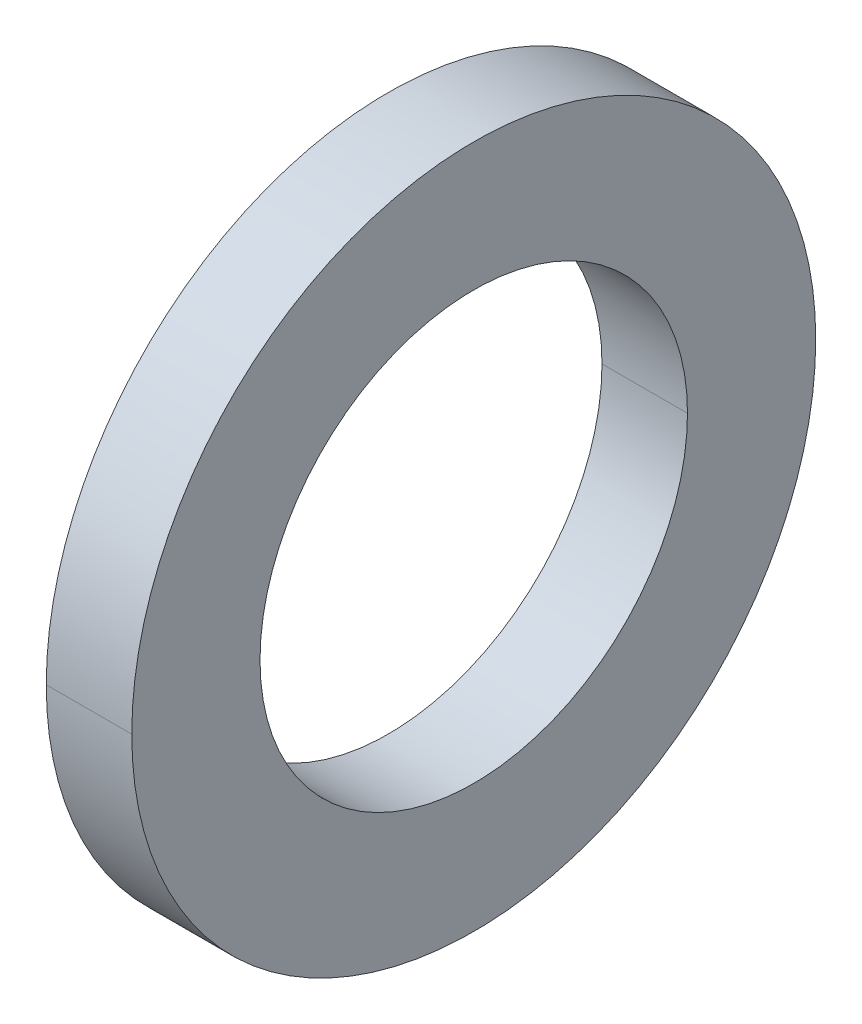
ISO-10303-21;
HEADER;
FILE_DESCRIPTION(('STEP AP214'),'2;1');
FILE_NAME('part.step','',(''),(''),'','','');
FILE_SCHEMA(('AUTOMOTIVE_DESIGN { 1 0 10303 214 1 1 1 1 }'));
ENDSEC;
DATA;
#1=APPLICATION_CONTEXT('core data for automotive mechanical design processes');
#2=APPLICATION_PROTOCOL_DEFINITION('international standard','automotive_design',2000,#1);
#3=PRODUCT_CONTEXT('',#1,'mechanical');
#4=PRODUCT('Part','Part','',(#3));
#5=PRODUCT_RELATED_PRODUCT_CATEGORY('part','',(#4));
#6=PRODUCT_DEFINITION_FORMATION('','',#4);
#7=PRODUCT_DEFINITION_CONTEXT('part definition',#1,'design');
#8=PRODUCT_DEFINITION('design','',#6,#7);
#9=PRODUCT_DEFINITION_SHAPE('','',#8);
#10=(LENGTH_UNIT() NAMED_UNIT(*) SI_UNIT(.MILLI.,.METRE.));
#11=(NAMED_UNIT(*) PLANE_ANGLE_UNIT() SI_UNIT($,.RADIAN.));
#12=(NAMED_UNIT(*) SI_UNIT($,.STERADIAN.) SOLID_ANGLE_UNIT());
#13=UNCERTAINTY_MEASURE_WITH_UNIT(LENGTH_MEASURE(1.E-05),#10,'distance_accuracy_value','');
#14=(GEOMETRIC_REPRESENTATION_CONTEXT(3) GLOBAL_UNCERTAINTY_ASSIGNED_CONTEXT((#13)) GLOBAL_UNIT_ASSIGNED_CONTEXT((#10,
#11,#12)) REPRESENTATION_CONTEXT('',''));
#15=CARTESIAN_POINT('',(0.,0.,0.));
#16=DIRECTION('',(0.,0.,1.));
#17=DIRECTION('',(1.,0.,0.));
#18=AXIS2_PLACEMENT_3D('',#15,#16,#17);
#19=CARTESIAN_POINT('',(8.,0.,0.));
#20=DIRECTION('',(1.,0.,0.));
#21=DIRECTION('',(0.,1.,0.));
#22=AXIS2_PLACEMENT_3D('',#19,#20,#21);
#23=CYLINDRICAL_SURFACE('',#22,4.);
#24=DIRECTION('',(1.,0.,0.));
#25=VECTOR('',#24,1.);
#26=CARTESIAN_POINT('',(7.,0.,4.));
#27=LINE('',#26,#25);
#28=CARTESIAN_POINT('',(7.,0.,4.));
#29=VERTEX_POINT('',#28);
#30=CARTESIAN_POINT('',(8.,0.,4.));
#31=VERTEX_POINT('',#30);
#32=EDGE_CURVE('E11',#29,#31,#27,.T.);
#33=ORIENTED_EDGE('',*,*,#32,.F.);
#34=CARTESIAN_POINT('',(7.,0.,0.));
#35=DIRECTION('',(1.,0.,0.));
#36=DIRECTION('',(0.,0.,-1.));
#37=AXIS2_PLACEMENT_3D('',#34,#35,#36);
#38=CIRCLE('',#37,4.);
#39=CARTESIAN_POINT('',(7.,0.,-4.));
#40=VERTEX_POINT('',#39);
#41=EDGE_CURVE('E25',#29,#40,#38,.T.);
#42=ORIENTED_EDGE('',*,*,#41,.T.);
#43=DIRECTION('',(1.,0.,0.));
#44=VECTOR('',#43,1.);
#45=CARTESIAN_POINT('',(7.,0.,-4.));
#46=LINE('',#45,#44);
#47=CARTESIAN_POINT('',(8.,0.,-4.));
#48=VERTEX_POINT('',#47);
#49=EDGE_CURVE('E103',#40,#48,#46,.T.);
#50=ORIENTED_EDGE('',*,*,#49,.T.);
#51=CARTESIAN_POINT('',(8.,0.,0.));
#52=DIRECTION('',(1.,0.,0.));
#53=DIRECTION('',(0.,0.,-1.));
#54=AXIS2_PLACEMENT_3D('',#51,#52,#53);
#55=CIRCLE('',#54,4.);
#56=EDGE_CURVE('E98',#31,#48,#55,.T.);
#57=ORIENTED_EDGE('',*,*,#56,.F.);
#58=EDGE_LOOP('',(#33,#42,#50,#57));
#59=FACE_BOUND('',#58,.T.);
#60=ADVANCED_FACE('F17',(#59),#23,.T.);
#61=CARTESIAN_POINT('',(8.,2.5,0.));
#62=DIRECTION('',(1.,0.,0.));
#63=DIRECTION('',(0.,0.,-1.));
#64=AXIS2_PLACEMENT_3D('',#61,#62,#63);
#65=PLANE('',#64);
#66=CARTESIAN_POINT('',(8.,0.,0.));
#67=DIRECTION('',(1.,0.,0.));
#68=DIRECTION('',(0.,0.,-1.));
#69=AXIS2_PLACEMENT_3D('',#66,#67,#68);
#70=CIRCLE('',#69,4.);
#71=EDGE_CURVE('E93',#48,#31,#70,.T.);
#72=ORIENTED_EDGE('',*,*,#71,.T.);
#73=ORIENTED_EDGE('',*,*,#56,.T.);
#74=EDGE_LOOP('',(#72,#73));
#75=FACE_BOUND('',#74,.T.);
#76=CARTESIAN_POINT('',(8.,0.,0.));
#77=DIRECTION('',(1.,0.,0.));
#78=DIRECTION('',(0.,0.,-1.));
#79=AXIS2_PLACEMENT_3D('',#76,#77,#78);
#80=CIRCLE('',#79,2.5);
#81=CARTESIAN_POINT('',(8.,0.,2.5));
#82=VERTEX_POINT('',#81);
#83=CARTESIAN_POINT('',(8.,0.,-2.5));
#84=VERTEX_POINT('',#83);
#85=EDGE_CURVE('E69',#82,#84,#80,.T.);
#86=ORIENTED_EDGE('',*,*,#85,.F.);
#87=CARTESIAN_POINT('',(8.,0.,0.));
#88=DIRECTION('',(1.,0.,0.));
#89=DIRECTION('',(0.,0.,-1.));
#90=AXIS2_PLACEMENT_3D('',#87,#88,#89);
#91=CIRCLE('',#90,2.5);
#92=EDGE_CURVE('E86',#84,#82,#91,.T.);
#93=ORIENTED_EDGE('',*,*,#92,.F.);
#94=EDGE_LOOP('',(#86,#93));
#95=FACE_BOUND('',#94,.T.);
#96=ADVANCED_FACE('F116',(#75,#95),#65,.T.);
#97=CARTESIAN_POINT('',(8.,0.,0.));
#98=DIRECTION('',(1.,0.,0.));
#99=DIRECTION('',(0.,-1.,0.));
#100=AXIS2_PLACEMENT_3D('',#97,#98,#99);
#101=CYLINDRICAL_SURFACE('',#100,2.5);
#102=DIRECTION('',(1.,0.,0.));
#103=VECTOR('',#102,1.);
#104=CARTESIAN_POINT('',(7.,0.,2.5));
#105=LINE('',#104,#103);
#106=CARTESIAN_POINT('',(7.,0.,2.5));
#107=VERTEX_POINT('',#106);
#108=EDGE_CURVE('E61',#107,#82,#105,.T.);
#109=ORIENTED_EDGE('',*,*,#108,.F.);
#110=CARTESIAN_POINT('',(7.,0.,0.));
#111=DIRECTION('',(1.,0.,0.));
#112=DIRECTION('',(0.,0.,-1.));
#113=AXIS2_PLACEMENT_3D('',#110,#111,#112);
#114=CIRCLE('',#113,2.5);
#115=CARTESIAN_POINT('',(7.,0.,-2.5));
#116=VERTEX_POINT('',#115);
#117=EDGE_CURVE('E54',#116,#107,#114,.T.);
#118=ORIENTED_EDGE('',*,*,#117,.F.);
#119=DIRECTION('',(1.,0.,0.));
#120=VECTOR('',#119,1.);
#121=CARTESIAN_POINT('',(7.,0.,-2.5));
#122=LINE('',#121,#120);
#123=EDGE_CURVE('E58',#116,#84,#122,.T.);
#124=ORIENTED_EDGE('',*,*,#123,.T.);
#125=ORIENTED_EDGE('',*,*,#92,.T.);
#126=EDGE_LOOP('',(#109,#118,#124,#125));
#127=FACE_BOUND('',#126,.T.);
#128=ADVANCED_FACE('F56',(#127),#101,.F.);
#129=CARTESIAN_POINT('',(8.,0.,0.));
#130=DIRECTION('',(1.,0.,0.));
#131=DIRECTION('',(0.,1.,0.));
#132=AXIS2_PLACEMENT_3D('',#129,#130,#131);
#133=CYLINDRICAL_SURFACE('',#132,2.5);
#134=ORIENTED_EDGE('',*,*,#108,.T.);
#135=ORIENTED_EDGE('',*,*,#85,.T.);
#136=ORIENTED_EDGE('',*,*,#123,.F.);
#137=CARTESIAN_POINT('',(7.,0.,0.));
#138=DIRECTION('',(1.,0.,0.));
#139=DIRECTION('',(0.,0.,-1.));
#140=AXIS2_PLACEMENT_3D('',#137,#138,#139);
#141=CIRCLE('',#140,2.5);
#142=EDGE_CURVE('E68',#107,#116,#141,.T.);
#143=ORIENTED_EDGE('',*,*,#142,.F.);
#144=EDGE_LOOP('',(#134,#135,#136,#143));
#145=FACE_BOUND('',#144,.T.);
#146=ADVANCED_FACE('F67',(#145),#133,.F.);
#147=CARTESIAN_POINT('',(7.,4.,0.));
#148=DIRECTION('',(-1.,0.,0.));
#149=DIRECTION('',(0.,0.,1.));
#150=AXIS2_PLACEMENT_3D('',#147,#148,#149);
#151=PLANE('',#150);
#152=ORIENTED_EDGE('',*,*,#117,.T.);
#153=ORIENTED_EDGE('',*,*,#142,.T.);
#154=EDGE_LOOP('',(#152,#153));
#155=FACE_BOUND('',#154,.T.);
#156=ORIENTED_EDGE('',*,*,#41,.F.);
#157=CARTESIAN_POINT('',(7.,0.,0.));
#158=DIRECTION('',(1.,0.,0.));
#159=DIRECTION('',(0.,0.,-1.));
#160=AXIS2_PLACEMENT_3D('',#157,#158,#159);
#161=CIRCLE('',#160,4.);
#162=EDGE_CURVE('E73',#40,#29,#161,.T.);
#163=ORIENTED_EDGE('',*,*,#162,.F.);
#164=EDGE_LOOP('',(#156,#163));
#165=FACE_BOUND('',#164,.T.);
#166=ADVANCED_FACE('F71',(#155,#165),#151,.T.);
#167=CARTESIAN_POINT('',(8.,0.,0.));
#168=DIRECTION('',(1.,0.,0.));
#169=DIRECTION('',(0.,-1.,0.));
#170=AXIS2_PLACEMENT_3D('',#167,#168,#169);
#171=CYLINDRICAL_SURFACE('',#170,4.);
#172=ORIENTED_EDGE('',*,*,#32,.T.);
#173=ORIENTED_EDGE('',*,*,#71,.F.);
#174=ORIENTED_EDGE('',*,*,#49,.F.);
#175=ORIENTED_EDGE('',*,*,#162,.T.);
#176=EDGE_LOOP('',(#172,#173,#174,#175));
#177=FACE_BOUND('',#176,.T.);
#178=ADVANCED_FACE('F114',(#177),#171,.T.);
#179=CLOSED_SHELL('',(#60,#96,#128,#146,#166,#178));
#180=MANIFOLD_SOLID_BREP('B1',#179);
#181=ADVANCED_BREP_SHAPE_REPRESENTATION('',(#18,#180),#14);
#182=SHAPE_DEFINITION_REPRESENTATION(#9,#181);
ENDSEC;
END-ISO-10303-21;
